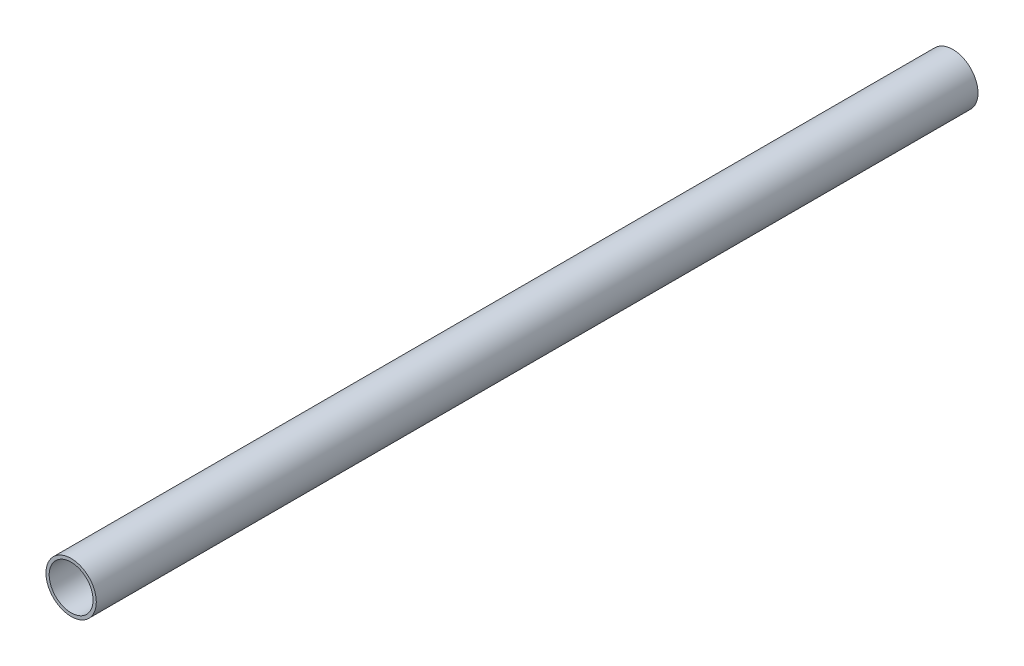
ISO-10303-21;
HEADER;
FILE_DESCRIPTION(('STEP AP214'),'2;1');
FILE_NAME('part.step','',(''),(''),'','','');
FILE_SCHEMA(('AUTOMOTIVE_DESIGN { 1 0 10303 214 1 1 1 1 }'));
ENDSEC;
DATA;
#1=APPLICATION_CONTEXT('core data for automotive mechanical design processes');
#2=APPLICATION_PROTOCOL_DEFINITION('international standard','automotive_design',2000,#1);
#3=PRODUCT_CONTEXT('',#1,'mechanical');
#4=PRODUCT('Part','Part','',(#3));
#5=PRODUCT_RELATED_PRODUCT_CATEGORY('part','',(#4));
#6=PRODUCT_DEFINITION_FORMATION('','',#4);
#7=PRODUCT_DEFINITION_CONTEXT('part definition',#1,'design');
#8=PRODUCT_DEFINITION('design','',#6,#7);
#9=PRODUCT_DEFINITION_SHAPE('','',#8);
#10=(LENGTH_UNIT() NAMED_UNIT(*) SI_UNIT(.MILLI.,.METRE.));
#11=(NAMED_UNIT(*) PLANE_ANGLE_UNIT() SI_UNIT($,.RADIAN.));
#12=(NAMED_UNIT(*) SI_UNIT($,.STERADIAN.) SOLID_ANGLE_UNIT());
#13=UNCERTAINTY_MEASURE_WITH_UNIT(LENGTH_MEASURE(1.E-05),#10,'distance_accuracy_value','');
#14=(GEOMETRIC_REPRESENTATION_CONTEXT(3) GLOBAL_UNCERTAINTY_ASSIGNED_CONTEXT((#13)) GLOBAL_UNIT_ASSIGNED_CONTEXT((#10,
#11,#12)) REPRESENTATION_CONTEXT('',''));
#15=CARTESIAN_POINT('',(0.,0.,0.));
#16=DIRECTION('',(0.,0.,1.));
#17=DIRECTION('',(1.,0.,0.));
#18=AXIS2_PLACEMENT_3D('',#15,#16,#17);
#19=CARTESIAN_POINT('',(0.,0.,111.1885));
#20=DIRECTION('',(0.,0.,1.));
#21=DIRECTION('',(1.,0.,0.));
#22=AXIS2_PLACEMENT_3D('',#19,#20,#21);
#23=PLANE('',#22);
#24=CARTESIAN_POINT('',(0.,0.,111.1885));
#25=DIRECTION('',(0.,0.,1.));
#26=DIRECTION('',(1.,0.,0.));
#27=AXIS2_PLACEMENT_3D('',#24,#25,#26);
#28=CIRCLE('',#27,6.35);
#29=CARTESIAN_POINT('',(6.35,0.,111.1885));
#30=VERTEX_POINT('',#29);
#31=EDGE_CURVE('E10',#30,#30,#28,.T.);
#32=ORIENTED_EDGE('',*,*,#31,.T.);
#33=EDGE_LOOP('',(#32));
#34=FACE_BOUND('',#33,.T.);
#35=CARTESIAN_POINT('',(0.,0.,111.1885));
#36=DIRECTION('',(0.,0.,1.));
#37=DIRECTION('',(1.,0.,0.));
#38=AXIS2_PLACEMENT_3D('',#35,#36,#37);
#39=CIRCLE('',#38,5.5372);
#40=CARTESIAN_POINT('',(5.5372,0.,111.1885));
#41=VERTEX_POINT('',#40);
#42=EDGE_CURVE('E43',#41,#41,#39,.T.);
#43=ORIENTED_EDGE('',*,*,#42,.F.);
#44=EDGE_LOOP('',(#43));
#45=FACE_BOUND('',#44,.T.);
#46=ADVANCED_FACE('F32',(#34,#45),#23,.T.);
#47=CARTESIAN_POINT('',(0.,0.,-111.1885));
#48=DIRECTION('',(0.,0.,1.));
#49=DIRECTION('',(1.,0.,0.));
#50=AXIS2_PLACEMENT_3D('',#47,#48,#49);
#51=PLANE('',#50);
#52=CARTESIAN_POINT('',(0.,0.,-111.1885));
#53=DIRECTION('',(0.,0.,1.));
#54=DIRECTION('',(1.,0.,0.));
#55=AXIS2_PLACEMENT_3D('',#52,#53,#54);
#56=CIRCLE('',#55,6.35);
#57=CARTESIAN_POINT('',(6.35,0.,-111.1885));
#58=VERTEX_POINT('',#57);
#59=EDGE_CURVE('E36',#58,#58,#56,.T.);
#60=ORIENTED_EDGE('',*,*,#59,.F.);
#61=EDGE_LOOP('',(#60));
#62=FACE_BOUND('',#61,.T.);
#63=CARTESIAN_POINT('',(0.,0.,-111.1885));
#64=DIRECTION('',(0.,0.,1.));
#65=DIRECTION('',(1.,0.,0.));
#66=AXIS2_PLACEMENT_3D('',#63,#64,#65);
#67=CIRCLE('',#66,5.5372);
#68=CARTESIAN_POINT('',(5.5372,0.,-111.1885));
#69=VERTEX_POINT('',#68);
#70=EDGE_CURVE('E45',#69,#69,#67,.T.);
#71=ORIENTED_EDGE('',*,*,#70,.T.);
#72=EDGE_LOOP('',(#71));
#73=FACE_BOUND('',#72,.T.);
#74=ADVANCED_FACE('F55',(#62,#73),#51,.F.);
#75=CARTESIAN_POINT('',(0.,0.,111.1885));
#76=DIRECTION('',(0.,0.,-1.));
#77=DIRECTION('',(-1.,0.,0.));
#78=AXIS2_PLACEMENT_3D('',#75,#76,#77);
#79=CYLINDRICAL_SURFACE('',#78,6.35);
#80=ORIENTED_EDGE('',*,*,#31,.F.);
#81=EDGE_LOOP('',(#80));
#82=FACE_BOUND('',#81,.T.);
#83=ORIENTED_EDGE('',*,*,#59,.T.);
#84=EDGE_LOOP('',(#83));
#85=FACE_BOUND('',#84,.T.);
#86=ADVANCED_FACE('F34',(#82,#85),#79,.T.);
#87=CARTESIAN_POINT('',(0.,0.,111.1885));
#88=DIRECTION('',(0.,0.,-1.));
#89=DIRECTION('',(-1.,0.,0.));
#90=AXIS2_PLACEMENT_3D('',#87,#88,#89);
#91=CYLINDRICAL_SURFACE('',#90,5.5372);
#92=ORIENTED_EDGE('',*,*,#42,.T.);
#93=EDGE_LOOP('',(#92));
#94=FACE_BOUND('',#93,.T.);
#95=ORIENTED_EDGE('',*,*,#70,.F.);
#96=EDGE_LOOP('',(#95));
#97=FACE_BOUND('',#96,.T.);
#98=ADVANCED_FACE('F51',(#94,#97),#91,.F.);
#99=CLOSED_SHELL('',(#46,#74,#86,#98));
#100=MANIFOLD_SOLID_BREP('B2',#99);
#101=ADVANCED_BREP_SHAPE_REPRESENTATION('',(#18,#100),#14);
#102=SHAPE_DEFINITION_REPRESENTATION(#9,#101);
ENDSEC;
END-ISO-10303-21;
